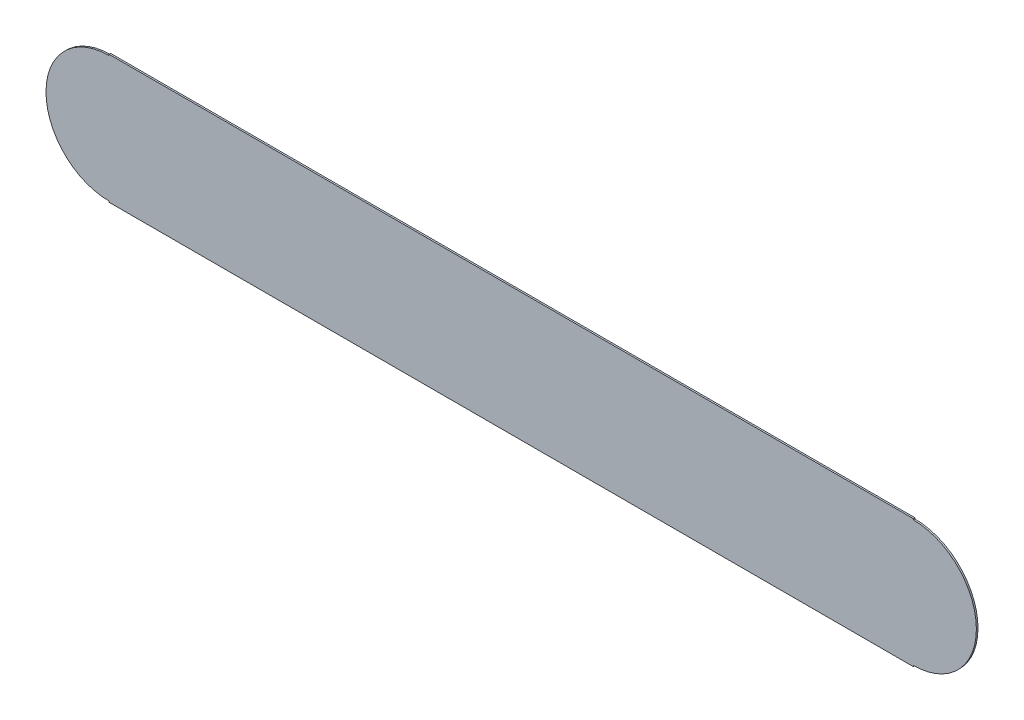
ISO-10303-21;
HEADER;
FILE_DESCRIPTION(('STEP AP214'),'2;1');
FILE_NAME('part.step','',(''),(''),'','','');
FILE_SCHEMA(('AUTOMOTIVE_DESIGN { 1 0 10303 214 1 1 1 1 }'));
ENDSEC;
DATA;
#1=APPLICATION_CONTEXT('core data for automotive mechanical design processes');
#2=APPLICATION_PROTOCOL_DEFINITION('international standard','automotive_design',2000,#1);
#3=PRODUCT_CONTEXT('',#1,'mechanical');
#4=PRODUCT('Part','Part','',(#3));
#5=PRODUCT_RELATED_PRODUCT_CATEGORY('part','',(#4));
#6=PRODUCT_DEFINITION_FORMATION('','',#4);
#7=PRODUCT_DEFINITION_CONTEXT('part definition',#1,'design');
#8=PRODUCT_DEFINITION('design','',#6,#7);
#9=PRODUCT_DEFINITION_SHAPE('','',#8);
#10=(LENGTH_UNIT() NAMED_UNIT(*) SI_UNIT(.MILLI.,.METRE.));
#11=(NAMED_UNIT(*) PLANE_ANGLE_UNIT() SI_UNIT($,.RADIAN.));
#12=(NAMED_UNIT(*) SI_UNIT($,.STERADIAN.) SOLID_ANGLE_UNIT());
#13=UNCERTAINTY_MEASURE_WITH_UNIT(LENGTH_MEASURE(1.E-05),#10,'distance_accuracy_value','');
#14=(GEOMETRIC_REPRESENTATION_CONTEXT(3) GLOBAL_UNCERTAINTY_ASSIGNED_CONTEXT((#13)) GLOBAL_UNIT_ASSIGNED_CONTEXT((#10,
#11,#12)) REPRESENTATION_CONTEXT('',''));
#15=CARTESIAN_POINT('',(0.,0.,0.));
#16=DIRECTION('',(0.,0.,1.));
#17=DIRECTION('',(1.,0.,0.));
#18=AXIS2_PLACEMENT_3D('',#15,#16,#17);
#19=CARTESIAN_POINT('',(0.,0.,57.));
#20=DIRECTION('',(0.,0.,1.));
#21=DIRECTION('',(1.,0.,0.));
#22=AXIS2_PLACEMENT_3D('',#19,#20,#21);
#23=PLANE('',#22);
#24=CARTESIAN_POINT('',(-300.,0.,57.));
#25=DIRECTION('',(0.,0.,1.));
#26=DIRECTION('',(1.,0.,0.));
#27=AXIS2_PLACEMENT_3D('',#24,#25,#26);
#28=CIRCLE('',#27,47.);
#29=CARTESIAN_POINT('',(-300.,-47.,57.));
#30=VERTEX_POINT('',#29);
#31=CARTESIAN_POINT('',(-300.,47.,57.));
#32=VERTEX_POINT('',#31);
#33=EDGE_CURVE('E146',#30,#32,#28,.F.);
#34=ORIENTED_EDGE('',*,*,#33,.F.);
#35=DIRECTION('',(0.,1.,0.));
#36=VECTOR('',#35,1.);
#37=CARTESIAN_POINT('',(-300.,-47.8,57.));
#38=LINE('',#37,#36);
#39=CARTESIAN_POINT('',(-300.,-47.8,57.));
#40=VERTEX_POINT('',#39);
#41=EDGE_CURVE('E135',#40,#30,#38,.T.);
#42=ORIENTED_EDGE('',*,*,#41,.F.);
#43=DIRECTION('',(-1.,0.,0.));
#44=VECTOR('',#43,1.);
#45=CARTESIAN_POINT('',(-300.,-47.8,57.));
#46=LINE('',#45,#44);
#47=CARTESIAN_POINT('',(300.,-47.8000000000001,57.));
#48=VERTEX_POINT('',#47);
#49=EDGE_CURVE('E133',#48,#40,#46,.T.);
#50=ORIENTED_EDGE('',*,*,#49,.F.);
#51=DIRECTION('',(0.,1.,0.));
#52=VECTOR('',#51,1.);
#53=CARTESIAN_POINT('',(300.,-47.8000000000001,57.));
#54=LINE('',#53,#52);
#55=CARTESIAN_POINT('',(300.,-47.0000000000001,57.));
#56=VERTEX_POINT('',#55);
#57=EDGE_CURVE('E138',#48,#56,#54,.T.);
#58=ORIENTED_EDGE('',*,*,#57,.T.);
#59=CARTESIAN_POINT('',(300.,0.,57.));
#60=DIRECTION('',(0.,0.,1.));
#61=DIRECTION('',(1.,0.,0.));
#62=AXIS2_PLACEMENT_3D('',#59,#60,#61);
#63=CIRCLE('',#62,47.0000000000001);
#64=CARTESIAN_POINT('',(300.,47.0000000000001,57.));
#65=VERTEX_POINT('',#64);
#66=EDGE_CURVE('E148',#65,#56,#63,.F.);
#67=ORIENTED_EDGE('',*,*,#66,.F.);
#68=DIRECTION('',(0.,-1.,0.));
#69=VECTOR('',#68,1.);
#70=CARTESIAN_POINT('',(300.,47.8000000000001,57.));
#71=LINE('',#70,#69);
#72=CARTESIAN_POINT('',(300.,47.8000000000001,57.));
#73=VERTEX_POINT('',#72);
#74=EDGE_CURVE('E105',#73,#65,#71,.T.);
#75=ORIENTED_EDGE('',*,*,#74,.F.);
#76=DIRECTION('',(1.,0.,0.));
#77=VECTOR('',#76,1.);
#78=CARTESIAN_POINT('',(-300.,47.8,57.));
#79=LINE('',#78,#77);
#80=CARTESIAN_POINT('',(-300.,47.8,57.));
#81=VERTEX_POINT('',#80);
#82=EDGE_CURVE('E98',#81,#73,#79,.T.);
#83=ORIENTED_EDGE('',*,*,#82,.F.);
#84=DIRECTION('',(0.,-1.,0.));
#85=VECTOR('',#84,1.);
#86=CARTESIAN_POINT('',(-300.,47.8,57.));
#87=LINE('',#86,#85);
#88=EDGE_CURVE('E102',#81,#32,#87,.T.);
#89=ORIENTED_EDGE('',*,*,#88,.T.);
#90=EDGE_LOOP('',(#34,#42,#50,#58,#67,#75,#83,#89));
#91=FACE_BOUND('',#90,.T.);
#92=ADVANCED_FACE('F32',(#91),#23,.T.);
#93=CARTESIAN_POINT('',(-300.,0.,55.8));
#94=DIRECTION('',(0.,0.,1.));
#95=DIRECTION('',(1.,0.,0.));
#96=AXIS2_PLACEMENT_3D('',#93,#94,#95);
#97=PLANE('',#96);
#98=CARTESIAN_POINT('',(-300.,0.,55.8));
#99=DIRECTION('',(0.,0.,1.));
#100=DIRECTION('',(1.,0.,0.));
#101=AXIS2_PLACEMENT_3D('',#98,#99,#100);
#102=CIRCLE('',#101,47.);
#103=CARTESIAN_POINT('',(-300.,47.,55.8));
#104=VERTEX_POINT('',#103);
#105=CARTESIAN_POINT('',(-300.,-47.,55.8));
#106=VERTEX_POINT('',#105);
#107=EDGE_CURVE('E11',#104,#106,#102,.T.);
#108=ORIENTED_EDGE('',*,*,#107,.F.);
#109=DIRECTION('',(0.,-1.,0.));
#110=VECTOR('',#109,1.);
#111=CARTESIAN_POINT('',(-300.,47.8,55.8));
#112=LINE('',#111,#110);
#113=CARTESIAN_POINT('',(-300.,47.8,55.8));
#114=VERTEX_POINT('',#113);
#115=EDGE_CURVE('E176',#114,#104,#112,.T.);
#116=ORIENTED_EDGE('',*,*,#115,.F.);
#117=DIRECTION('',(-1.,0.,0.));
#118=VECTOR('',#117,1.);
#119=CARTESIAN_POINT('',(-300.,47.8,55.8));
#120=LINE('',#119,#118);
#121=CARTESIAN_POINT('',(300.,47.8000000000001,55.8));
#122=VERTEX_POINT('',#121);
#123=EDGE_CURVE('E114',#122,#114,#120,.T.);
#124=ORIENTED_EDGE('',*,*,#123,.F.);
#125=DIRECTION('',(0.,-1.,0.));
#126=VECTOR('',#125,1.);
#127=CARTESIAN_POINT('',(300.,47.8000000000001,55.8));
#128=LINE('',#127,#126);
#129=CARTESIAN_POINT('',(300.,47.0000000000001,55.8));
#130=VERTEX_POINT('',#129);
#131=EDGE_CURVE('E126',#122,#130,#128,.T.);
#132=ORIENTED_EDGE('',*,*,#131,.T.);
#133=CARTESIAN_POINT('',(300.,0.,55.8));
#134=DIRECTION('',(0.,0.,1.));
#135=DIRECTION('',(1.,0.,0.));
#136=AXIS2_PLACEMENT_3D('',#133,#134,#135);
#137=CIRCLE('',#136,47.0000000000001);
#138=CARTESIAN_POINT('',(300.,-47.0000000000001,55.8));
#139=VERTEX_POINT('',#138);
#140=EDGE_CURVE('E41',#139,#130,#137,.T.);
#141=ORIENTED_EDGE('',*,*,#140,.F.);
#142=DIRECTION('',(0.,1.,0.));
#143=VECTOR('',#142,1.);
#144=CARTESIAN_POINT('',(300.,-47.8000000000001,55.8));
#145=LINE('',#144,#143);
#146=CARTESIAN_POINT('',(300.,-47.8000000000001,55.8));
#147=VERTEX_POINT('',#146);
#148=EDGE_CURVE('E141',#147,#139,#145,.T.);
#149=ORIENTED_EDGE('',*,*,#148,.F.);
#150=DIRECTION('',(1.,0.,0.));
#151=VECTOR('',#150,1.);
#152=CARTESIAN_POINT('',(-300.,-47.8,55.8));
#153=LINE('',#152,#151);
#154=CARTESIAN_POINT('',(-300.,-47.8,55.8));
#155=VERTEX_POINT('',#154);
#156=EDGE_CURVE('E124',#155,#147,#153,.T.);
#157=ORIENTED_EDGE('',*,*,#156,.F.);
#158=DIRECTION('',(0.,1.,0.));
#159=VECTOR('',#158,1.);
#160=CARTESIAN_POINT('',(-300.,-47.8,55.8));
#161=LINE('',#160,#159);
#162=EDGE_CURVE('E144',#155,#106,#161,.T.);
#163=ORIENTED_EDGE('',*,*,#162,.T.);
#164=EDGE_LOOP('',(#108,#116,#124,#132,#141,#149,#157,#163));
#165=FACE_BOUND('',#164,.T.);
#166=ADVANCED_FACE('F170',(#165),#97,.F.);
#167=CARTESIAN_POINT('',(-300.,0.,55.8));
#168=DIRECTION('',(0.,0.,1.));
#169=DIRECTION('',(1.,0.,0.));
#170=AXIS2_PLACEMENT_3D('',#167,#168,#169);
#171=CYLINDRICAL_SURFACE('',#170,47.);
#172=DIRECTION('',(0.,0.,1.));
#173=VECTOR('',#172,1.);
#174=CARTESIAN_POINT('',(-300.,-47.,55.8));
#175=LINE('',#174,#173);
#176=EDGE_CURVE('E36',#106,#30,#175,.T.);
#177=ORIENTED_EDGE('',*,*,#176,.T.);
#178=ORIENTED_EDGE('',*,*,#33,.T.);
#179=DIRECTION('',(0.,0.,1.));
#180=VECTOR('',#179,1.);
#181=CARTESIAN_POINT('',(-300.,47.,55.8));
#182=LINE('',#181,#180);
#183=EDGE_CURVE('E119',#104,#32,#182,.T.);
#184=ORIENTED_EDGE('',*,*,#183,.F.);
#185=ORIENTED_EDGE('',*,*,#107,.T.);
#186=EDGE_LOOP('',(#177,#178,#184,#185));
#187=FACE_BOUND('',#186,.T.);
#188=ADVANCED_FACE('F157',(#187),#171,.T.);
#189=CARTESIAN_POINT('',(300.,0.,55.8));
#190=DIRECTION('',(0.,0.,1.));
#191=DIRECTION('',(1.,0.,0.));
#192=AXIS2_PLACEMENT_3D('',#189,#190,#191);
#193=CYLINDRICAL_SURFACE('',#192,47.0000000000001);
#194=DIRECTION('',(0.,0.,1.));
#195=VECTOR('',#194,1.);
#196=CARTESIAN_POINT('',(300.,47.0000000000001,55.8));
#197=LINE('',#196,#195);
#198=EDGE_CURVE('E152',#130,#65,#197,.T.);
#199=ORIENTED_EDGE('',*,*,#198,.T.);
#200=ORIENTED_EDGE('',*,*,#66,.T.);
#201=DIRECTION('',(0.,0.,1.));
#202=VECTOR('',#201,1.);
#203=CARTESIAN_POINT('',(300.,-47.0000000000001,55.8));
#204=LINE('',#203,#202);
#205=EDGE_CURVE('E55',#139,#56,#204,.T.);
#206=ORIENTED_EDGE('',*,*,#205,.F.);
#207=ORIENTED_EDGE('',*,*,#140,.T.);
#208=EDGE_LOOP('',(#199,#200,#206,#207));
#209=FACE_BOUND('',#208,.T.);
#210=ADVANCED_FACE('F34',(#209),#193,.T.);
#211=CARTESIAN_POINT('',(-300.,-47.8,57.));
#212=DIRECTION('',(1.,0.,0.));
#213=DIRECTION('',(0.,1.,0.));
#214=AXIS2_PLACEMENT_3D('',#211,#212,#213);
#215=PLANE('',#214);
#216=ORIENTED_EDGE('',*,*,#176,.F.);
#217=ORIENTED_EDGE('',*,*,#162,.F.);
#218=DIRECTION('',(0.,0.,-1.));
#219=VECTOR('',#218,1.);
#220=CARTESIAN_POINT('',(-300.,-47.8,57.));
#221=LINE('',#220,#219);
#222=EDGE_CURVE('E121',#40,#155,#221,.T.);
#223=ORIENTED_EDGE('',*,*,#222,.F.);
#224=ORIENTED_EDGE('',*,*,#41,.T.);
#225=EDGE_LOOP('',(#216,#217,#223,#224));
#226=FACE_BOUND('',#225,.T.);
#227=ADVANCED_FACE('F163',(#226),#215,.F.);
#228=CARTESIAN_POINT('',(300.,-47.8000000000001,57.));
#229=DIRECTION('',(-1.,0.,0.));
#230=DIRECTION('',(0.,-1.,0.));
#231=AXIS2_PLACEMENT_3D('',#228,#229,#230);
#232=PLANE('',#231);
#233=ORIENTED_EDGE('',*,*,#205,.T.);
#234=ORIENTED_EDGE('',*,*,#57,.F.);
#235=DIRECTION('',(0.,0.,1.));
#236=VECTOR('',#235,1.);
#237=CARTESIAN_POINT('',(300.,-47.8000000000001,57.));
#238=LINE('',#237,#236);
#239=EDGE_CURVE('E131',#147,#48,#238,.T.);
#240=ORIENTED_EDGE('',*,*,#239,.F.);
#241=ORIENTED_EDGE('',*,*,#148,.T.);
#242=EDGE_LOOP('',(#233,#234,#240,#241));
#243=FACE_BOUND('',#242,.T.);
#244=ADVANCED_FACE('F168',(#243),#232,.F.);
#245=CARTESIAN_POINT('',(0.,-47.8,0.));
#246=DIRECTION('',(0.,-1.,0.));
#247=DIRECTION('',(1.,0.,0.));
#248=AXIS2_PLACEMENT_3D('',#245,#246,#247);
#249=PLANE('',#248);
#250=ORIENTED_EDGE('',*,*,#222,.T.);
#251=ORIENTED_EDGE('',*,*,#156,.T.);
#252=ORIENTED_EDGE('',*,*,#239,.T.);
#253=ORIENTED_EDGE('',*,*,#49,.T.);
#254=EDGE_LOOP('',(#250,#251,#252,#253));
#255=FACE_BOUND('',#254,.T.);
#256=ADVANCED_FACE('F165',(#255),#249,.T.);
#257=CARTESIAN_POINT('',(-300.,47.8,55.8));
#258=DIRECTION('',(1.,0.,0.));
#259=DIRECTION('',(0.,1.,0.));
#260=AXIS2_PLACEMENT_3D('',#257,#258,#259);
#261=PLANE('',#260);
#262=ORIENTED_EDGE('',*,*,#183,.T.);
#263=ORIENTED_EDGE('',*,*,#88,.F.);
#264=DIRECTION('',(0.,0.,1.));
#265=VECTOR('',#264,1.);
#266=CARTESIAN_POINT('',(-300.,47.8,55.8));
#267=LINE('',#266,#265);
#268=EDGE_CURVE('E109',#114,#81,#267,.T.);
#269=ORIENTED_EDGE('',*,*,#268,.F.);
#270=ORIENTED_EDGE('',*,*,#115,.T.);
#271=EDGE_LOOP('',(#262,#263,#269,#270));
#272=FACE_BOUND('',#271,.T.);
#273=ADVANCED_FACE('F118',(#272),#261,.F.);
#274=CARTESIAN_POINT('',(300.,47.8000000000001,55.8));
#275=DIRECTION('',(-1.,0.,0.));
#276=DIRECTION('',(0.,-1.,0.));
#277=AXIS2_PLACEMENT_3D('',#274,#275,#276);
#278=PLANE('',#277);
#279=ORIENTED_EDGE('',*,*,#198,.F.);
#280=ORIENTED_EDGE('',*,*,#131,.F.);
#281=DIRECTION('',(0.,0.,-1.));
#282=VECTOR('',#281,1.);
#283=CARTESIAN_POINT('',(300.,47.8000000000001,55.8));
#284=LINE('',#283,#282);
#285=EDGE_CURVE('E108',#73,#122,#284,.T.);
#286=ORIENTED_EDGE('',*,*,#285,.F.);
#287=ORIENTED_EDGE('',*,*,#74,.T.);
#288=EDGE_LOOP('',(#279,#280,#286,#287));
#289=FACE_BOUND('',#288,.T.);
#290=ADVANCED_FACE('F174',(#289),#278,.F.);
#291=CARTESIAN_POINT('',(0.,47.8,0.));
#292=DIRECTION('',(0.,1.,0.));
#293=DIRECTION('',(-1.,0.,0.));
#294=AXIS2_PLACEMENT_3D('',#291,#292,#293);
#295=PLANE('',#294);
#296=ORIENTED_EDGE('',*,*,#268,.T.);
#297=ORIENTED_EDGE('',*,*,#82,.T.);
#298=ORIENTED_EDGE('',*,*,#285,.T.);
#299=ORIENTED_EDGE('',*,*,#123,.T.);
#300=EDGE_LOOP('',(#296,#297,#298,#299));
#301=FACE_BOUND('',#300,.T.);
#302=ADVANCED_FACE('F112',(#301),#295,.T.);
#303=CLOSED_SHELL('',(#92,#166,#188,#210,#227,#244,#256,#273,#290,#302));
#304=MANIFOLD_SOLID_BREP('B2',#303);
#305=ADVANCED_BREP_SHAPE_REPRESENTATION('',(#18,#304),#14);
#306=SHAPE_DEFINITION_REPRESENTATION(#9,#305);
ENDSEC;
END-ISO-10303-21;
